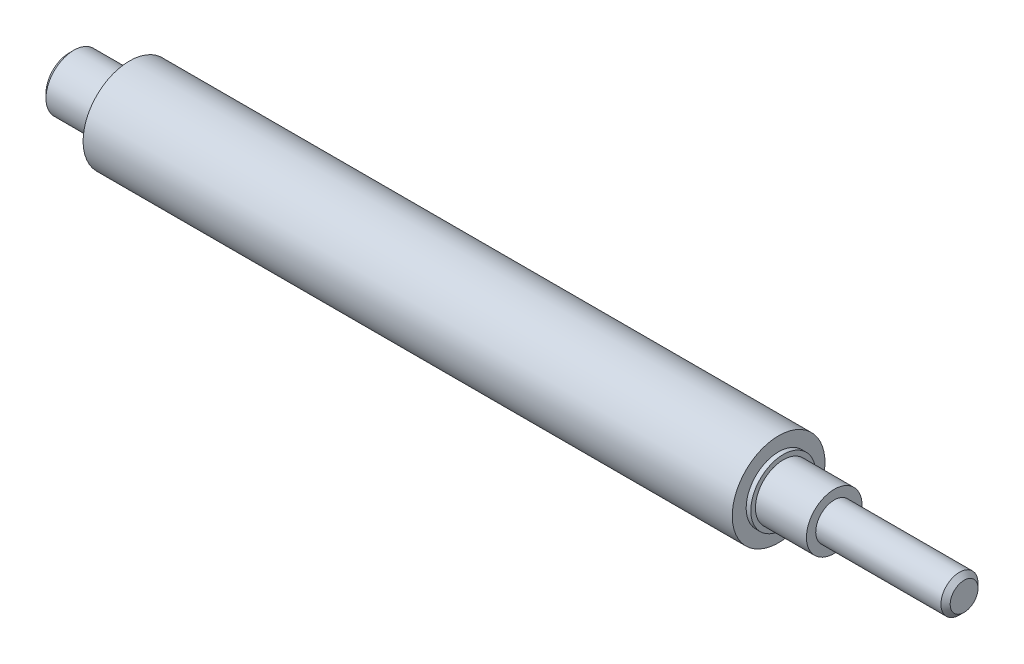
ISO-10303-21;
HEADER;
FILE_DESCRIPTION(('STEP AP214'),'2;1');
FILE_NAME('part.step','',(''),(''),'','','');
FILE_SCHEMA(('AUTOMOTIVE_DESIGN { 1 0 10303 214 1 1 1 1 }'));
ENDSEC;
DATA;
#1=APPLICATION_CONTEXT('core data for automotive mechanical design processes');
#2=APPLICATION_PROTOCOL_DEFINITION('international standard','automotive_design',2000,#1);
#3=PRODUCT_CONTEXT('',#1,'mechanical');
#4=PRODUCT('Part','Part','',(#3));
#5=PRODUCT_RELATED_PRODUCT_CATEGORY('part','',(#4));
#6=PRODUCT_DEFINITION_FORMATION('','',#4);
#7=PRODUCT_DEFINITION_CONTEXT('part definition',#1,'design');
#8=PRODUCT_DEFINITION('design','',#6,#7);
#9=PRODUCT_DEFINITION_SHAPE('','',#8);
#10=(LENGTH_UNIT() NAMED_UNIT(*) SI_UNIT(.MILLI.,.METRE.));
#11=(NAMED_UNIT(*) PLANE_ANGLE_UNIT() SI_UNIT($,.RADIAN.));
#12=(NAMED_UNIT(*) SI_UNIT($,.STERADIAN.) SOLID_ANGLE_UNIT());
#13=UNCERTAINTY_MEASURE_WITH_UNIT(LENGTH_MEASURE(1.E-05),#10,'distance_accuracy_value','');
#14=(GEOMETRIC_REPRESENTATION_CONTEXT(3) GLOBAL_UNCERTAINTY_ASSIGNED_CONTEXT((#13)) GLOBAL_UNIT_ASSIGNED_CONTEXT((#10,
#11,#12)) REPRESENTATION_CONTEXT('',''));
#15=CARTESIAN_POINT('',(0.,0.,0.));
#16=DIRECTION('',(0.,0.,1.));
#17=DIRECTION('',(1.,0.,0.));
#18=AXIS2_PLACEMENT_3D('',#15,#16,#17);
#19=CARTESIAN_POINT('',(0.,0.,0.));
#20=DIRECTION('',(-1.,0.,0.));
#21=DIRECTION('',(0.,-1.,0.));
#22=AXIS2_PLACEMENT_3D('',#19,#20,#21);
#23=PLANE('',#22);
#24=CARTESIAN_POINT('',(0.,0.,0.));
#25=DIRECTION('',(-1.,0.,0.));
#26=DIRECTION('',(0.,-1.,0.));
#27=AXIS2_PLACEMENT_3D('',#24,#25,#26);
#28=CIRCLE('',#27,2.49999999999999);
#29=CARTESIAN_POINT('',(0.,-2.49999999999999,0.));
#30=VERTEX_POINT('',#29);
#31=EDGE_CURVE('E10',#30,#30,#28,.T.);
#32=ORIENTED_EDGE('',*,*,#31,.T.);
#33=EDGE_LOOP('',(#32));
#34=FACE_BOUND('',#33,.T.);
#35=ADVANCED_FACE('F33',(#34),#23,.T.);
#36=CARTESIAN_POINT('',(96.5,0.,0.));
#37=DIRECTION('',(1.,0.,0.));
#38=DIRECTION('',(0.,1.,0.));
#39=AXIS2_PLACEMENT_3D('',#36,#37,#38);
#40=CYLINDRICAL_SURFACE('',#39,2.99999999999999);
#41=CARTESIAN_POINT('',(0.5,0.,0.));
#42=DIRECTION('',(-1.,0.,0.));
#43=DIRECTION('',(0.,-1.,0.));
#44=AXIS2_PLACEMENT_3D('',#41,#42,#43);
#45=CIRCLE('',#44,2.99999999999999);
#46=CARTESIAN_POINT('',(0.5,-2.99999999999999,0.));
#47=VERTEX_POINT('',#46);
#48=EDGE_CURVE('E40',#47,#47,#45,.F.);
#49=ORIENTED_EDGE('',*,*,#48,.T.);
#50=EDGE_LOOP('',(#49));
#51=FACE_BOUND('',#50,.T.);
#52=CARTESIAN_POINT('',(6.00000000000001,0.,0.));
#53=DIRECTION('',(1.,0.,0.));
#54=DIRECTION('',(0.,1.,0.));
#55=AXIS2_PLACEMENT_3D('',#52,#53,#54);
#56=CIRCLE('',#55,2.99999999999999);
#57=CARTESIAN_POINT('',(6.00000000000001,2.99999999999999,0.));
#58=VERTEX_POINT('',#57);
#59=EDGE_CURVE('E53',#58,#58,#56,.T.);
#60=ORIENTED_EDGE('',*,*,#59,.F.);
#61=EDGE_LOOP('',(#60));
#62=FACE_BOUND('',#61,.T.);
#63=ADVANCED_FACE('F102',(#51,#62),#40,.T.);
#64=CARTESIAN_POINT('',(6.,2.99999999999999,0.));
#65=DIRECTION('',(-1.,0.,0.));
#66=DIRECTION('',(0.,-1.,0.));
#67=AXIS2_PLACEMENT_3D('',#64,#65,#66);
#68=PLANE('',#67);
#69=ORIENTED_EDGE('',*,*,#59,.T.);
#70=EDGE_LOOP('',(#69));
#71=FACE_BOUND('',#70,.T.);
#72=CARTESIAN_POINT('',(6.00000000000001,0.,0.));
#73=DIRECTION('',(1.,0.,0.));
#74=DIRECTION('',(0.,1.,0.));
#75=AXIS2_PLACEMENT_3D('',#72,#73,#74);
#76=CIRCLE('',#75,3.49999999999999);
#77=CARTESIAN_POINT('',(6.00000000000001,3.49999999999999,0.));
#78=VERTEX_POINT('',#77);
#79=EDGE_CURVE('E56',#78,#78,#76,.T.);
#80=ORIENTED_EDGE('',*,*,#79,.F.);
#81=EDGE_LOOP('',(#80));
#82=FACE_BOUND('',#81,.T.);
#83=ADVANCED_FACE('F107',(#71,#82),#68,.T.);
#84=CARTESIAN_POINT('',(96.5,0.,0.));
#85=DIRECTION('',(1.,0.,0.));
#86=DIRECTION('',(0.,1.,0.));
#87=AXIS2_PLACEMENT_3D('',#84,#85,#86);
#88=CYLINDRICAL_SURFACE('',#87,3.49999999999999);
#89=ORIENTED_EDGE('',*,*,#79,.T.);
#90=EDGE_LOOP('',(#89));
#91=FACE_BOUND('',#90,.T.);
#92=CARTESIAN_POINT('',(6.50000000000001,0.,0.));
#93=DIRECTION('',(1.,0.,0.));
#94=DIRECTION('',(0.,1.,0.));
#95=AXIS2_PLACEMENT_3D('',#92,#93,#94);
#96=CIRCLE('',#95,3.49999999999999);
#97=CARTESIAN_POINT('',(6.50000000000001,3.49999999999999,0.));
#98=VERTEX_POINT('',#97);
#99=EDGE_CURVE('E59',#98,#98,#96,.T.);
#100=ORIENTED_EDGE('',*,*,#99,.F.);
#101=EDGE_LOOP('',(#100));
#102=FACE_BOUND('',#101,.T.);
#103=ADVANCED_FACE('F200',(#91,#102),#88,.T.);
#104=CARTESIAN_POINT('',(6.5,3.49999999999999,0.));
#105=DIRECTION('',(-1.,0.,0.));
#106=DIRECTION('',(0.,-1.,0.));
#107=AXIS2_PLACEMENT_3D('',#104,#105,#106);
#108=PLANE('',#107);
#109=ORIENTED_EDGE('',*,*,#99,.T.);
#110=EDGE_LOOP('',(#109));
#111=FACE_BOUND('',#110,.T.);
#112=CARTESIAN_POINT('',(6.50000000000001,0.,0.));
#113=DIRECTION('',(1.,0.,0.));
#114=DIRECTION('',(0.,1.,0.));
#115=AXIS2_PLACEMENT_3D('',#112,#113,#114);
#116=CIRCLE('',#115,4.99999999999999);
#117=CARTESIAN_POINT('',(6.50000000000001,4.99999999999999,0.));
#118=VERTEX_POINT('',#117);
#119=EDGE_CURVE('E62',#118,#118,#116,.T.);
#120=ORIENTED_EDGE('',*,*,#119,.F.);
#121=EDGE_LOOP('',(#120));
#122=FACE_BOUND('',#121,.T.);
#123=ADVANCED_FACE('F190',(#111,#122),#108,.T.);
#124=CARTESIAN_POINT('',(96.5,0.,0.));
#125=DIRECTION('',(1.,0.,0.));
#126=DIRECTION('',(0.,1.,0.));
#127=AXIS2_PLACEMENT_3D('',#124,#125,#126);
#128=CYLINDRICAL_SURFACE('',#127,4.99999999999999);
#129=ORIENTED_EDGE('',*,*,#119,.T.);
#130=EDGE_LOOP('',(#129));
#131=FACE_BOUND('',#130,.T.);
#132=CARTESIAN_POINT('',(76.5,0.,0.));
#133=DIRECTION('',(1.,0.,0.));
#134=DIRECTION('',(0.,1.,0.));
#135=AXIS2_PLACEMENT_3D('',#132,#133,#134);
#136=CIRCLE('',#135,4.99999999999999);
#137=CARTESIAN_POINT('',(76.5,4.99999999999999,0.));
#138=VERTEX_POINT('',#137);
#139=EDGE_CURVE('E65',#138,#138,#136,.T.);
#140=ORIENTED_EDGE('',*,*,#139,.F.);
#141=EDGE_LOOP('',(#140));
#142=FACE_BOUND('',#141,.T.);
#143=ADVANCED_FACE('F180',(#131,#142),#128,.T.);
#144=CARTESIAN_POINT('',(76.5,4.99999999999999,0.));
#145=DIRECTION('',(1.,0.,0.));
#146=DIRECTION('',(0.,1.,0.));
#147=AXIS2_PLACEMENT_3D('',#144,#145,#146);
#148=PLANE('',#147);
#149=ORIENTED_EDGE('',*,*,#139,.T.);
#150=EDGE_LOOP('',(#149));
#151=FACE_BOUND('',#150,.T.);
#152=CARTESIAN_POINT('',(76.5,0.,0.));
#153=DIRECTION('',(1.,0.,0.));
#154=DIRECTION('',(0.,1.,0.));
#155=AXIS2_PLACEMENT_3D('',#152,#153,#154);
#156=CIRCLE('',#155,3.49999999999999);
#157=CARTESIAN_POINT('',(76.5,3.49999999999999,0.));
#158=VERTEX_POINT('',#157);
#159=EDGE_CURVE('E68',#158,#158,#156,.T.);
#160=ORIENTED_EDGE('',*,*,#159,.F.);
#161=EDGE_LOOP('',(#160));
#162=FACE_BOUND('',#161,.T.);
#163=ADVANCED_FACE('F170',(#151,#162),#148,.T.);
#164=CARTESIAN_POINT('',(96.5,0.,0.));
#165=DIRECTION('',(1.,0.,0.));
#166=DIRECTION('',(0.,1.,0.));
#167=AXIS2_PLACEMENT_3D('',#164,#165,#166);
#168=CYLINDRICAL_SURFACE('',#167,3.49999999999999);
#169=ORIENTED_EDGE('',*,*,#159,.T.);
#170=EDGE_LOOP('',(#169));
#171=FACE_BOUND('',#170,.T.);
#172=CARTESIAN_POINT('',(77.,0.,0.));
#173=DIRECTION('',(1.,0.,0.));
#174=DIRECTION('',(0.,1.,0.));
#175=AXIS2_PLACEMENT_3D('',#172,#173,#174);
#176=CIRCLE('',#175,3.49999999999999);
#177=CARTESIAN_POINT('',(77.,3.49999999999999,0.));
#178=VERTEX_POINT('',#177);
#179=EDGE_CURVE('E71',#178,#178,#176,.T.);
#180=ORIENTED_EDGE('',*,*,#179,.F.);
#181=EDGE_LOOP('',(#180));
#182=FACE_BOUND('',#181,.T.);
#183=ADVANCED_FACE('F160',(#171,#182),#168,.T.);
#184=CARTESIAN_POINT('',(77.,3.49999999999999,0.));
#185=DIRECTION('',(1.,0.,0.));
#186=DIRECTION('',(0.,1.,0.));
#187=AXIS2_PLACEMENT_3D('',#184,#185,#186);
#188=PLANE('',#187);
#189=ORIENTED_EDGE('',*,*,#179,.T.);
#190=EDGE_LOOP('',(#189));
#191=FACE_BOUND('',#190,.T.);
#192=CARTESIAN_POINT('',(77.,0.,0.));
#193=DIRECTION('',(1.,0.,0.));
#194=DIRECTION('',(0.,1.,0.));
#195=AXIS2_PLACEMENT_3D('',#192,#193,#194);
#196=CIRCLE('',#195,2.99999999999999);
#197=CARTESIAN_POINT('',(77.,2.99999999999999,0.));
#198=VERTEX_POINT('',#197);
#199=EDGE_CURVE('E74',#198,#198,#196,.T.);
#200=ORIENTED_EDGE('',*,*,#199,.F.);
#201=EDGE_LOOP('',(#200));
#202=FACE_BOUND('',#201,.T.);
#203=ADVANCED_FACE('F98',(#191,#202),#188,.T.);
#204=CARTESIAN_POINT('',(96.5,0.,0.));
#205=DIRECTION('',(1.,0.,0.));
#206=DIRECTION('',(0.,1.,0.));
#207=AXIS2_PLACEMENT_3D('',#204,#205,#206);
#208=CYLINDRICAL_SURFACE('',#207,2.99999999999999);
#209=ORIENTED_EDGE('',*,*,#199,.T.);
#210=EDGE_LOOP('',(#209));
#211=FACE_BOUND('',#210,.T.);
#212=CARTESIAN_POINT('',(82.5,0.,0.));
#213=DIRECTION('',(1.,0.,0.));
#214=DIRECTION('',(0.,1.,0.));
#215=AXIS2_PLACEMENT_3D('',#212,#213,#214);
#216=CIRCLE('',#215,2.99999999999999);
#217=CARTESIAN_POINT('',(82.5,2.99999999999999,0.));
#218=VERTEX_POINT('',#217);
#219=EDGE_CURVE('E77',#218,#218,#216,.T.);
#220=ORIENTED_EDGE('',*,*,#219,.F.);
#221=EDGE_LOOP('',(#220));
#222=FACE_BOUND('',#221,.T.);
#223=ADVANCED_FACE('F88',(#211,#222),#208,.T.);
#224=CARTESIAN_POINT('',(82.5,2.99999999999999,0.));
#225=DIRECTION('',(1.,0.,0.));
#226=DIRECTION('',(0.,1.,0.));
#227=AXIS2_PLACEMENT_3D('',#224,#225,#226);
#228=PLANE('',#227);
#229=ORIENTED_EDGE('',*,*,#219,.T.);
#230=EDGE_LOOP('',(#229));
#231=FACE_BOUND('',#230,.T.);
#232=CARTESIAN_POINT('',(82.5,0.,0.));
#233=DIRECTION('',(1.,0.,0.));
#234=DIRECTION('',(0.,1.,0.));
#235=AXIS2_PLACEMENT_3D('',#232,#233,#234);
#236=CIRCLE('',#235,2.);
#237=CARTESIAN_POINT('',(82.5,2.,0.));
#238=VERTEX_POINT('',#237);
#239=EDGE_CURVE('E80',#238,#238,#236,.T.);
#240=ORIENTED_EDGE('',*,*,#239,.F.);
#241=EDGE_LOOP('',(#240));
#242=FACE_BOUND('',#241,.T.);
#243=ADVANCED_FACE('F86',(#231,#242),#228,.T.);
#244=CARTESIAN_POINT('',(96.5,0.,0.));
#245=DIRECTION('',(1.,0.,0.));
#246=DIRECTION('',(0.,1.,0.));
#247=AXIS2_PLACEMENT_3D('',#244,#245,#246);
#248=CYLINDRICAL_SURFACE('',#247,2.);
#249=CARTESIAN_POINT('',(96.,0.,0.));
#250=DIRECTION('',(1.,0.,0.));
#251=DIRECTION('',(0.,1.,0.));
#252=AXIS2_PLACEMENT_3D('',#249,#250,#251);
#253=CIRCLE('',#252,2.);
#254=CARTESIAN_POINT('',(96.,2.,0.));
#255=VERTEX_POINT('',#254);
#256=EDGE_CURVE('E44',#255,#255,#253,.F.);
#257=ORIENTED_EDGE('',*,*,#256,.T.);
#258=EDGE_LOOP('',(#257));
#259=FACE_BOUND('',#258,.T.);
#260=ORIENTED_EDGE('',*,*,#239,.T.);
#261=EDGE_LOOP('',(#260));
#262=FACE_BOUND('',#261,.T.);
#263=ADVANCED_FACE('F84',(#259,#262),#248,.T.);
#264=CARTESIAN_POINT('',(96.5,2.,0.));
#265=DIRECTION('',(1.,0.,0.));
#266=DIRECTION('',(0.,1.,0.));
#267=AXIS2_PLACEMENT_3D('',#264,#265,#266);
#268=PLANE('',#267);
#269=CARTESIAN_POINT('',(96.5,0.,0.));
#270=DIRECTION('',(1.,0.,0.));
#271=DIRECTION('',(0.,1.,0.));
#272=AXIS2_PLACEMENT_3D('',#269,#270,#271);
#273=CIRCLE('',#272,1.5);
#274=CARTESIAN_POINT('',(96.5,1.5,0.));
#275=VERTEX_POINT('',#274);
#276=EDGE_CURVE('E48',#275,#275,#273,.T.);
#277=ORIENTED_EDGE('',*,*,#276,.T.);
#278=EDGE_LOOP('',(#277));
#279=FACE_BOUND('',#278,.T.);
#280=ADVANCED_FACE('F95',(#279),#268,.T.);
#281=CARTESIAN_POINT('',(96.5,0.,0.));
#282=DIRECTION('',(-1.,0.,0.));
#283=DIRECTION('',(0.,-1.,0.));
#284=AXIS2_PLACEMENT_3D('',#281,#282,#283);
#285=CONICAL_SURFACE('',#284,1.5,0.785398163397459);
#286=ORIENTED_EDGE('',*,*,#256,.F.);
#287=EDGE_LOOP('',(#286));
#288=FACE_BOUND('',#287,.T.);
#289=ORIENTED_EDGE('',*,*,#276,.F.);
#290=EDGE_LOOP('',(#289));
#291=FACE_BOUND('',#290,.T.);
#292=ADVANCED_FACE('F110',(#288,#291),#285,.T.);
#293=CARTESIAN_POINT('',(0.5,0.,0.));
#294=DIRECTION('',(1.,0.,0.));
#295=DIRECTION('',(0.,1.,0.));
#296=AXIS2_PLACEMENT_3D('',#293,#294,#295);
#297=CONICAL_SURFACE('',#296,2.99999999999999,0.785398163397448);
#298=ORIENTED_EDGE('',*,*,#31,.F.);
#299=EDGE_LOOP('',(#298));
#300=FACE_BOUND('',#299,.T.);
#301=ORIENTED_EDGE('',*,*,#48,.F.);
#302=EDGE_LOOP('',(#301));
#303=FACE_BOUND('',#302,.T.);
#304=ADVANCED_FACE('F35',(#300,#303),#297,.T.);
#305=CLOSED_SHELL('',(#35,#63,#83,#103,#123,#143,#163,#183,#203,#223,#243,#263,#280,#292,#304));
#306=MANIFOLD_SOLID_BREP('B2',#305);
#307=ADVANCED_BREP_SHAPE_REPRESENTATION('',(#18,#306),#14);
#308=SHAPE_DEFINITION_REPRESENTATION(#9,#307);
ENDSEC;
END-ISO-10303-21;
